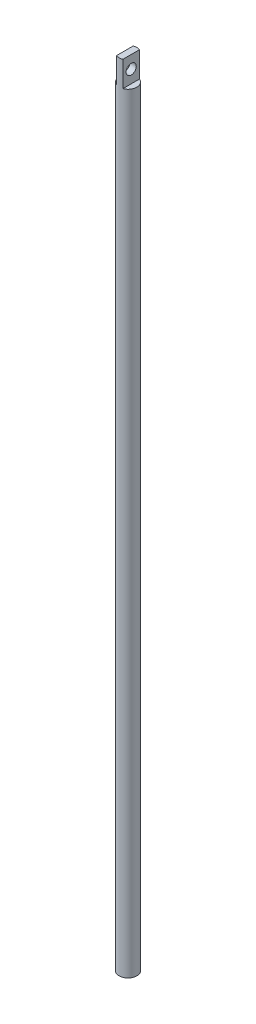
ISO-10303-21;
HEADER;
FILE_DESCRIPTION(('STEP AP214'),'2;1');
FILE_NAME('part.step','',(''),(''),'','','');
FILE_SCHEMA(('AUTOMOTIVE_DESIGN { 1 0 10303 214 1 1 1 1 }'));
ENDSEC;
DATA;
#1=APPLICATION_CONTEXT('core data for automotive mechanical design processes');
#2=APPLICATION_PROTOCOL_DEFINITION('international standard','automotive_design',2000,#1);
#3=PRODUCT_CONTEXT('',#1,'mechanical');
#4=PRODUCT('Part','Part','',(#3));
#5=PRODUCT_RELATED_PRODUCT_CATEGORY('part','',(#4));
#6=PRODUCT_DEFINITION_FORMATION('','',#4);
#7=PRODUCT_DEFINITION_CONTEXT('part definition',#1,'design');
#8=PRODUCT_DEFINITION('design','',#6,#7);
#9=PRODUCT_DEFINITION_SHAPE('','',#8);
#10=(LENGTH_UNIT() NAMED_UNIT(*) SI_UNIT(.MILLI.,.METRE.));
#11=(NAMED_UNIT(*) PLANE_ANGLE_UNIT() SI_UNIT($,.RADIAN.));
#12=(NAMED_UNIT(*) SI_UNIT($,.STERADIAN.) SOLID_ANGLE_UNIT());
#13=UNCERTAINTY_MEASURE_WITH_UNIT(LENGTH_MEASURE(1.E-05),#10,'distance_accuracy_value','');
#14=(GEOMETRIC_REPRESENTATION_CONTEXT(3) GLOBAL_UNCERTAINTY_ASSIGNED_CONTEXT((#13)) GLOBAL_UNIT_ASSIGNED_CONTEXT((#10,
#11,#12)) REPRESENTATION_CONTEXT('',''));
#15=CARTESIAN_POINT('',(0.,0.,0.));
#16=DIRECTION('',(0.,0.,1.));
#17=DIRECTION('',(1.,0.,0.));
#18=AXIS2_PLACEMENT_3D('',#15,#16,#17);
#19=CARTESIAN_POINT('',(0.,15.,0.));
#20=DIRECTION('',(0.,-1.,0.));
#21=DIRECTION('',(0.,0.,-1.));
#22=AXIS2_PLACEMENT_3D('',#19,#20,#21);
#23=CYLINDRICAL_SURFACE('',#22,7.);
#24=CARTESIAN_POINT('',(0.,0.,0.));
#25=DIRECTION('',(0.,1.,0.));
#26=DIRECTION('',(0.,0.,1.));
#27=AXIS2_PLACEMENT_3D('',#24,#25,#26);
#28=CIRCLE('',#27,7.);
#29=CARTESIAN_POINT('',(0.,0.,7.));
#30=VERTEX_POINT('',#29);
#31=EDGE_CURVE('E85',#30,#30,#28,.T.);
#32=ORIENTED_EDGE('',*,*,#31,.T.);
#33=EDGE_LOOP('',(#32));
#34=FACE_BOUND('',#33,.T.);
#35=DIRECTION('',(0.,-1.,0.));
#36=VECTOR('',#35,1.);
#37=CARTESIAN_POINT('',(2.5,15.,6.53834841531101));
#38=LINE('',#37,#36);
#39=CARTESIAN_POINT('',(2.5,625.,6.53834841531101));
#40=VERTEX_POINT('',#39);
#41=CARTESIAN_POINT('',(2.5,605.,6.53834841531101));
#42=VERTEX_POINT('',#41);
#43=EDGE_CURVE('E98',#40,#42,#38,.T.);
#44=ORIENTED_EDGE('',*,*,#43,.F.);
#45=CARTESIAN_POINT('',(0.,625.,0.));
#46=DIRECTION('',(0.,1.,0.));
#47=DIRECTION('',(0.,0.,1.));
#48=AXIS2_PLACEMENT_3D('',#45,#46,#47);
#49=CIRCLE('',#48,7.);
#50=CARTESIAN_POINT('',(-2.5,625.,6.53834841531101));
#51=VERTEX_POINT('',#50);
#52=EDGE_CURVE('E94',#51,#40,#49,.T.);
#53=ORIENTED_EDGE('',*,*,#52,.F.);
#54=DIRECTION('',(0.,-1.,0.));
#55=VECTOR('',#54,1.);
#56=CARTESIAN_POINT('',(-2.5,15.,6.53834841531101));
#57=LINE('',#56,#55);
#58=CARTESIAN_POINT('',(-2.5,605.,6.53834841531101));
#59=VERTEX_POINT('',#58);
#60=EDGE_CURVE('E51',#59,#51,#57,.F.);
#61=ORIENTED_EDGE('',*,*,#60,.F.);
#62=CARTESIAN_POINT('',(0.,605.,0.));
#63=DIRECTION('',(0.,1.,0.));
#64=DIRECTION('',(0.,0.,1.));
#65=AXIS2_PLACEMENT_3D('',#62,#63,#64);
#66=CIRCLE('',#65,7.);
#67=CARTESIAN_POINT('',(-2.5,605.,-6.53834841531101));
#68=VERTEX_POINT('',#67);
#69=EDGE_CURVE('E44',#68,#59,#66,.T.);
#70=ORIENTED_EDGE('',*,*,#69,.F.);
#71=DIRECTION('',(0.,-1.,0.));
#72=VECTOR('',#71,1.);
#73=CARTESIAN_POINT('',(-2.5,15.,-6.53834841531101));
#74=LINE('',#73,#72);
#75=CARTESIAN_POINT('',(-2.5,625.,-6.53834841531101));
#76=VERTEX_POINT('',#75);
#77=EDGE_CURVE('E78',#76,#68,#74,.T.);
#78=ORIENTED_EDGE('',*,*,#77,.F.);
#79=CARTESIAN_POINT('',(2.5,625.,-6.53834841531101));
#80=VERTEX_POINT('',#79);
#81=EDGE_CURVE('E91',#80,#76,#49,.T.);
#82=ORIENTED_EDGE('',*,*,#81,.F.);
#83=DIRECTION('',(0.,-1.,0.));
#84=VECTOR('',#83,1.);
#85=CARTESIAN_POINT('',(2.5,15.,-6.53834841531101));
#86=LINE('',#85,#84);
#87=CARTESIAN_POINT('',(2.5,605.,-6.53834841531101));
#88=VERTEX_POINT('',#87);
#89=EDGE_CURVE('E59',#88,#80,#86,.F.);
#90=ORIENTED_EDGE('',*,*,#89,.F.);
#91=EDGE_CURVE('E12',#42,#88,#66,.T.);
#92=ORIENTED_EDGE('',*,*,#91,.F.);
#93=EDGE_LOOP('',(#44,#53,#61,#70,#78,#82,#90,#92));
#94=FACE_BOUND('',#93,.T.);
#95=ADVANCED_FACE('F36',(#34,#94),#23,.T.);
#96=CARTESIAN_POINT('',(0.,625.,0.));
#97=DIRECTION('',(0.,1.,0.));
#98=DIRECTION('',(0.,0.,1.));
#99=AXIS2_PLACEMENT_3D('',#96,#97,#98);
#100=PLANE('',#99);
#101=ORIENTED_EDGE('',*,*,#52,.T.);
#102=DIRECTION('',(0.,0.,-1.));
#103=VECTOR('',#102,1.);
#104=CARTESIAN_POINT('',(2.5,625.,0.));
#105=LINE('',#104,#103);
#106=EDGE_CURVE('E84',#40,#80,#105,.T.);
#107=ORIENTED_EDGE('',*,*,#106,.T.);
#108=ORIENTED_EDGE('',*,*,#81,.T.);
#109=DIRECTION('',(0.,0.,1.));
#110=VECTOR('',#109,1.);
#111=CARTESIAN_POINT('',(-2.5,625.,0.));
#112=LINE('',#111,#110);
#113=EDGE_CURVE('E75',#76,#51,#112,.T.);
#114=ORIENTED_EDGE('',*,*,#113,.T.);
#115=EDGE_LOOP('',(#101,#107,#108,#114));
#116=FACE_BOUND('',#115,.T.);
#117=ADVANCED_FACE('F93',(#116),#100,.T.);
#118=CARTESIAN_POINT('',(0.,0.,0.));
#119=DIRECTION('',(0.,1.,0.));
#120=DIRECTION('',(0.,0.,1.));
#121=AXIS2_PLACEMENT_3D('',#118,#119,#120);
#122=PLANE('',#121);
#123=ORIENTED_EDGE('',*,*,#31,.F.);
#124=EDGE_LOOP('',(#123));
#125=FACE_BOUND('',#124,.T.);
#126=ADVANCED_FACE('F123',(#125),#122,.F.);
#127=CARTESIAN_POINT('',(-2.5,605.,-10.));
#128=DIRECTION('',(-1.,0.,0.));
#129=DIRECTION('',(0.,0.,1.));
#130=AXIS2_PLACEMENT_3D('',#127,#128,#129);
#131=PLANE('',#130);
#132=CARTESIAN_POINT('',(-2.5,615.000000000005,0.));
#133=DIRECTION('',(-1.,0.,0.));
#134=DIRECTION('',(0.,0.,1.));
#135=AXIS2_PLACEMENT_3D('',#132,#133,#134);
#136=CIRCLE('',#135,4.00000000000001);
#137=CARTESIAN_POINT('',(-2.5,615.000000000005,4.00000000000001));
#138=VERTEX_POINT('',#137);
#139=EDGE_CURVE('E115',#138,#138,#136,.T.);
#140=ORIENTED_EDGE('',*,*,#139,.F.);
#141=EDGE_LOOP('',(#140));
#142=FACE_BOUND('',#141,.T.);
#143=ORIENTED_EDGE('',*,*,#77,.T.);
#144=DIRECTION('',(0.,0.,1.));
#145=VECTOR('',#144,1.);
#146=CARTESIAN_POINT('',(-2.5,605.,-10.));
#147=LINE('',#146,#145);
#148=EDGE_CURVE('E104',#68,#59,#147,.T.);
#149=ORIENTED_EDGE('',*,*,#148,.T.);
#150=ORIENTED_EDGE('',*,*,#60,.T.);
#151=ORIENTED_EDGE('',*,*,#113,.F.);
#152=EDGE_LOOP('',(#143,#149,#150,#151));
#153=FACE_BOUND('',#152,.T.);
#154=ADVANCED_FACE('F77',(#142,#153),#131,.T.);
#155=CARTESIAN_POINT('',(0.,605.,0.));
#156=DIRECTION('',(0.,1.,0.));
#157=DIRECTION('',(0.,0.,1.));
#158=AXIS2_PLACEMENT_3D('',#155,#156,#157);
#159=PLANE('',#158);
#160=ORIENTED_EDGE('',*,*,#69,.T.);
#161=ORIENTED_EDGE('',*,*,#148,.F.);
#162=EDGE_LOOP('',(#160,#161));
#163=FACE_BOUND('',#162,.T.);
#164=ADVANCED_FACE('F103',(#163),#159,.T.);
#165=ORIENTED_EDGE('',*,*,#91,.T.);
#166=DIRECTION('',(0.,0.,-1.));
#167=VECTOR('',#166,1.);
#168=CARTESIAN_POINT('',(2.5,605.,-10.));
#169=LINE('',#168,#167);
#170=EDGE_CURVE('E105',#42,#88,#169,.T.);
#171=ORIENTED_EDGE('',*,*,#170,.F.);
#172=EDGE_LOOP('',(#165,#171));
#173=FACE_BOUND('',#172,.T.);
#174=ADVANCED_FACE('F113',(#173),#159,.T.);
#175=CARTESIAN_POINT('',(2.5,605.,-10.));
#176=DIRECTION('',(1.,0.,0.));
#177=DIRECTION('',(0.,0.,-1.));
#178=AXIS2_PLACEMENT_3D('',#175,#176,#177);
#179=PLANE('',#178);
#180=CARTESIAN_POINT('',(2.5,615.000000000005,0.));
#181=DIRECTION('',(1.,0.,0.));
#182=DIRECTION('',(0.,0.,-1.));
#183=AXIS2_PLACEMENT_3D('',#180,#181,#182);
#184=CIRCLE('',#183,4.00000000000001);
#185=CARTESIAN_POINT('',(2.5,615.000000000005,-4.00000000000001));
#186=VERTEX_POINT('',#185);
#187=EDGE_CURVE('E39',#186,#186,#184,.T.);
#188=ORIENTED_EDGE('',*,*,#187,.F.);
#189=EDGE_LOOP('',(#188));
#190=FACE_BOUND('',#189,.T.);
#191=ORIENTED_EDGE('',*,*,#43,.T.);
#192=ORIENTED_EDGE('',*,*,#170,.T.);
#193=ORIENTED_EDGE('',*,*,#89,.T.);
#194=ORIENTED_EDGE('',*,*,#106,.F.);
#195=EDGE_LOOP('',(#191,#192,#193,#194));
#196=FACE_BOUND('',#195,.T.);
#197=ADVANCED_FACE('F110',(#190,#196),#179,.T.);
#198=CARTESIAN_POINT('',(17.5,615.000000000005,0.));
#199=DIRECTION('',(-1.,0.,0.));
#200=DIRECTION('',(0.,0.,1.));
#201=AXIS2_PLACEMENT_3D('',#198,#199,#200);
#202=CYLINDRICAL_SURFACE('',#201,4.00000000000001);
#203=ORIENTED_EDGE('',*,*,#187,.T.);
#204=EDGE_LOOP('',(#203));
#205=FACE_BOUND('',#204,.T.);
#206=ORIENTED_EDGE('',*,*,#139,.T.);
#207=EDGE_LOOP('',(#206));
#208=FACE_BOUND('',#207,.T.);
#209=ADVANCED_FACE('F120',(#205,#208),#202,.F.);
#210=CLOSED_SHELL('',(#95,#117,#126,#154,#164,#174,#197,#209));
#211=MANIFOLD_SOLID_BREP('B2',#210);
#212=ADVANCED_BREP_SHAPE_REPRESENTATION('',(#18,#211),#14);
#213=SHAPE_DEFINITION_REPRESENTATION(#9,#212);
ENDSEC;
END-ISO-10303-21;
